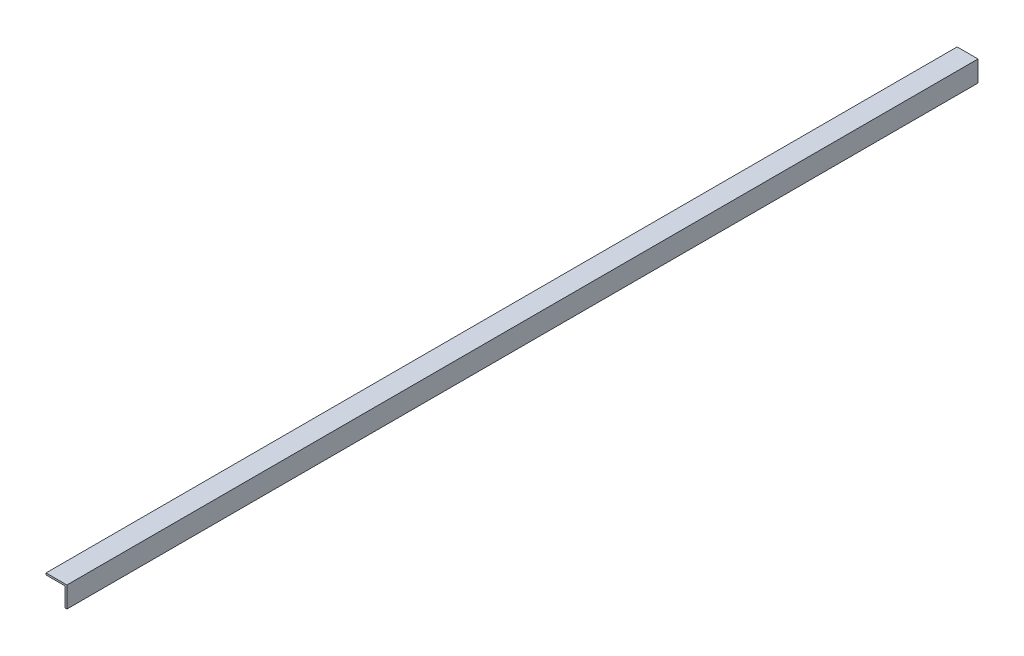
ISO-10303-21;
HEADER;
FILE_DESCRIPTION(('STEP AP214'),'2;1');
FILE_NAME('part.step','',(''),(''),'','','');
FILE_SCHEMA(('AUTOMOTIVE_DESIGN { 1 0 10303 214 1 1 1 1 }'));
ENDSEC;
DATA;
#1=APPLICATION_CONTEXT('core data for automotive mechanical design processes');
#2=APPLICATION_PROTOCOL_DEFINITION('international standard','automotive_design',2000,#1);
#3=PRODUCT_CONTEXT('',#1,'mechanical');
#4=PRODUCT('Part','Part','',(#3));
#5=PRODUCT_RELATED_PRODUCT_CATEGORY('part','',(#4));
#6=PRODUCT_DEFINITION_FORMATION('','',#4);
#7=PRODUCT_DEFINITION_CONTEXT('part definition',#1,'design');
#8=PRODUCT_DEFINITION('design','',#6,#7);
#9=PRODUCT_DEFINITION_SHAPE('','',#8);
#10=(LENGTH_UNIT() NAMED_UNIT(*) SI_UNIT(.MILLI.,.METRE.));
#11=(NAMED_UNIT(*) PLANE_ANGLE_UNIT() SI_UNIT($,.RADIAN.));
#12=(NAMED_UNIT(*) SI_UNIT($,.STERADIAN.) SOLID_ANGLE_UNIT());
#13=UNCERTAINTY_MEASURE_WITH_UNIT(LENGTH_MEASURE(1.E-05),#10,'distance_accuracy_value','');
#14=(GEOMETRIC_REPRESENTATION_CONTEXT(3) GLOBAL_UNCERTAINTY_ASSIGNED_CONTEXT((#13)) GLOBAL_UNIT_ASSIGNED_CONTEXT((#10,
#11,#12)) REPRESENTATION_CONTEXT('',''));
#15=CARTESIAN_POINT('',(0.,0.,0.));
#16=DIRECTION('',(0.,0.,1.));
#17=DIRECTION('',(1.,0.,0.));
#18=AXIS2_PLACEMENT_3D('',#15,#16,#17);
#19=CARTESIAN_POINT('',(0.,-38.1,1662.1125));
#20=DIRECTION('',(-1.,0.,0.));
#21=DIRECTION('',(0.,0.,1.));
#22=AXIS2_PLACEMENT_3D('',#19,#20,#21);
#23=PLANE('',#22);
#24=DIRECTION('',(0.,1.,0.));
#25=VECTOR('',#24,1.);
#26=CARTESIAN_POINT('',(0.,-38.1,0.));
#27=LINE('',#26,#25);
#28=CARTESIAN_POINT('',(0.,-38.1,0.));
#29=VERTEX_POINT('',#28);
#30=CARTESIAN_POINT('',(0.,0.,0.));
#31=VERTEX_POINT('',#30);
#32=EDGE_CURVE('E121',#29,#31,#27,.T.);
#33=ORIENTED_EDGE('',*,*,#32,.T.);
#34=DIRECTION('',(0.,0.,-1.));
#35=VECTOR('',#34,1.);
#36=CARTESIAN_POINT('',(0.,0.,1662.1125));
#37=LINE('',#36,#35);
#38=CARTESIAN_POINT('',(0.,0.,1662.1125));
#39=VERTEX_POINT('',#38);
#40=EDGE_CURVE('E11',#39,#31,#37,.T.);
#41=ORIENTED_EDGE('',*,*,#40,.F.);
#42=DIRECTION('',(0.,1.,0.));
#43=VECTOR('',#42,1.);
#44=CARTESIAN_POINT('',(0.,-38.1,1662.1125));
#45=LINE('',#44,#43);
#46=CARTESIAN_POINT('',(0.,-38.1,1662.1125));
#47=VERTEX_POINT('',#46);
#48=EDGE_CURVE('E131',#47,#39,#45,.T.);
#49=ORIENTED_EDGE('',*,*,#48,.F.);
#50=DIRECTION('',(0.,0.,-1.));
#51=VECTOR('',#50,1.);
#52=CARTESIAN_POINT('',(0.,-38.1,1662.1125));
#53=LINE('',#52,#51);
#54=EDGE_CURVE('E117',#47,#29,#53,.T.);
#55=ORIENTED_EDGE('',*,*,#54,.T.);
#56=EDGE_LOOP('',(#33,#41,#49,#55));
#57=FACE_BOUND('',#56,.T.);
#58=ADVANCED_FACE('F37',(#57),#23,.F.);
#59=CARTESIAN_POINT('',(0.,0.,1662.1125));
#60=DIRECTION('',(0.,-1.,0.));
#61=DIRECTION('',(1.,0.,0.));
#62=AXIS2_PLACEMENT_3D('',#59,#60,#61);
#63=PLANE('',#62);
#64=DIRECTION('',(-1.,0.,0.));
#65=VECTOR('',#64,1.);
#66=CARTESIAN_POINT('',(0.,0.,0.));
#67=LINE('',#66,#65);
#68=CARTESIAN_POINT('',(-38.1,0.,0.));
#69=VERTEX_POINT('',#68);
#70=EDGE_CURVE('E124',#31,#69,#67,.T.);
#71=ORIENTED_EDGE('',*,*,#70,.T.);
#72=DIRECTION('',(0.,0.,-1.));
#73=VECTOR('',#72,1.);
#74=CARTESIAN_POINT('',(-38.1,0.,1662.1125));
#75=LINE('',#74,#73);
#76=CARTESIAN_POINT('',(-38.1,0.,1662.1125));
#77=VERTEX_POINT('',#76);
#78=EDGE_CURVE('E45',#77,#69,#75,.T.);
#79=ORIENTED_EDGE('',*,*,#78,.F.);
#80=DIRECTION('',(-1.,0.,0.));
#81=VECTOR('',#80,1.);
#82=CARTESIAN_POINT('',(0.,0.,1662.1125));
#83=LINE('',#82,#81);
#84=EDGE_CURVE('E90',#39,#77,#83,.T.);
#85=ORIENTED_EDGE('',*,*,#84,.F.);
#86=ORIENTED_EDGE('',*,*,#40,.T.);
#87=EDGE_LOOP('',(#71,#79,#85,#86));
#88=FACE_BOUND('',#87,.T.);
#89=ADVANCED_FACE('F155',(#88),#63,.F.);
#90=CARTESIAN_POINT('',(-38.1,0.,1662.1125));
#91=DIRECTION('',(1.,0.,0.));
#92=DIRECTION('',(0.,0.,-1.));
#93=AXIS2_PLACEMENT_3D('',#90,#91,#92);
#94=PLANE('',#93);
#95=DIRECTION('',(0.,-1.,0.));
#96=VECTOR('',#95,1.);
#97=CARTESIAN_POINT('',(-38.1,0.,0.));
#98=LINE('',#97,#96);
#99=CARTESIAN_POINT('',(-38.1,-3.17500000000001,0.));
#100=VERTEX_POINT('',#99);
#101=EDGE_CURVE('E126',#69,#100,#98,.T.);
#102=ORIENTED_EDGE('',*,*,#101,.T.);
#103=DIRECTION('',(0.,0.,-1.));
#104=VECTOR('',#103,1.);
#105=CARTESIAN_POINT('',(-38.1,-3.17500000000001,1662.1125));
#106=LINE('',#105,#104);
#107=CARTESIAN_POINT('',(-38.1,-3.17500000000001,1662.1125));
#108=VERTEX_POINT('',#107);
#109=EDGE_CURVE('E112',#108,#100,#106,.T.);
#110=ORIENTED_EDGE('',*,*,#109,.F.);
#111=DIRECTION('',(0.,-1.,0.));
#112=VECTOR('',#111,1.);
#113=CARTESIAN_POINT('',(-38.1,0.,1662.1125));
#114=LINE('',#113,#112);
#115=EDGE_CURVE('E103',#77,#108,#114,.T.);
#116=ORIENTED_EDGE('',*,*,#115,.F.);
#117=ORIENTED_EDGE('',*,*,#78,.T.);
#118=EDGE_LOOP('',(#102,#110,#116,#117));
#119=FACE_BOUND('',#118,.T.);
#120=ADVANCED_FACE('F137',(#119),#94,.F.);
#121=CARTESIAN_POINT('',(-38.1,-3.17500000000001,1662.1125));
#122=DIRECTION('',(0.,1.,0.));
#123=DIRECTION('',(0.,0.,1.));
#124=AXIS2_PLACEMENT_3D('',#121,#122,#123);
#125=PLANE('',#124);
#126=DIRECTION('',(1.,0.,0.));
#127=VECTOR('',#126,1.);
#128=CARTESIAN_POINT('',(-38.1,-3.17500000000001,0.));
#129=LINE('',#128,#127);
#130=CARTESIAN_POINT('',(-3.17500000000001,-3.17500000000001,0.));
#131=VERTEX_POINT('',#130);
#132=EDGE_CURVE('E111',#100,#131,#129,.T.);
#133=ORIENTED_EDGE('',*,*,#132,.T.);
#134=DIRECTION('',(0.,0.,-1.));
#135=VECTOR('',#134,1.);
#136=CARTESIAN_POINT('',(-3.17500000000001,-3.17500000000001,1662.1125));
#137=LINE('',#136,#135);
#138=CARTESIAN_POINT('',(-3.17500000000001,-3.17500000000001,1662.1125));
#139=VERTEX_POINT('',#138);
#140=EDGE_CURVE('E108',#139,#131,#137,.T.);
#141=ORIENTED_EDGE('',*,*,#140,.F.);
#142=DIRECTION('',(1.,0.,0.));
#143=VECTOR('',#142,1.);
#144=CARTESIAN_POINT('',(-38.1,-3.17500000000001,1662.1125));
#145=LINE('',#144,#143);
#146=EDGE_CURVE('E97',#108,#139,#145,.T.);
#147=ORIENTED_EDGE('',*,*,#146,.F.);
#148=ORIENTED_EDGE('',*,*,#109,.T.);
#149=EDGE_LOOP('',(#133,#141,#147,#148));
#150=FACE_BOUND('',#149,.T.);
#151=ADVANCED_FACE('F109',(#150),#125,.F.);
#152=CARTESIAN_POINT('',(-3.17500000000001,-3.17500000000001,1662.1125));
#153=DIRECTION('',(1.,0.,0.));
#154=DIRECTION('',(0.,1.,0.));
#155=AXIS2_PLACEMENT_3D('',#152,#153,#154);
#156=PLANE('',#155);
#157=DIRECTION('',(0.,-1.,0.));
#158=VECTOR('',#157,1.);
#159=CARTESIAN_POINT('',(-3.17500000000001,-3.17500000000001,0.));
#160=LINE('',#159,#158);
#161=CARTESIAN_POINT('',(-3.175,-38.1,0.));
#162=VERTEX_POINT('',#161);
#163=EDGE_CURVE('E76',#131,#162,#160,.T.);
#164=ORIENTED_EDGE('',*,*,#163,.T.);
#165=DIRECTION('',(0.,0.,-1.));
#166=VECTOR('',#165,1.);
#167=CARTESIAN_POINT('',(-3.175,-38.1,1662.1125));
#168=LINE('',#167,#166);
#169=CARTESIAN_POINT('',(-3.175,-38.1,1662.1125));
#170=VERTEX_POINT('',#169);
#171=EDGE_CURVE('E113',#170,#162,#168,.T.);
#172=ORIENTED_EDGE('',*,*,#171,.F.);
#173=DIRECTION('',(0.,-1.,0.));
#174=VECTOR('',#173,1.);
#175=CARTESIAN_POINT('',(-3.17500000000001,-3.17500000000001,1662.1125));
#176=LINE('',#175,#174);
#177=EDGE_CURVE('E101',#139,#170,#176,.T.);
#178=ORIENTED_EDGE('',*,*,#177,.F.);
#179=ORIENTED_EDGE('',*,*,#140,.T.);
#180=EDGE_LOOP('',(#164,#172,#178,#179));
#181=FACE_BOUND('',#180,.T.);
#182=ADVANCED_FACE('F115',(#181),#156,.F.);
#183=CARTESIAN_POINT('',(-3.175,-38.1,1662.1125));
#184=DIRECTION('',(0.,1.,0.));
#185=DIRECTION('',(0.,0.,1.));
#186=AXIS2_PLACEMENT_3D('',#183,#184,#185);
#187=PLANE('',#186);
#188=DIRECTION('',(1.,0.,0.));
#189=VECTOR('',#188,1.);
#190=CARTESIAN_POINT('',(-3.175,-38.1,0.));
#191=LINE('',#190,#189);
#192=EDGE_CURVE('E82',#162,#29,#191,.T.);
#193=ORIENTED_EDGE('',*,*,#192,.T.);
#194=ORIENTED_EDGE('',*,*,#54,.F.);
#195=DIRECTION('',(1.,0.,0.));
#196=VECTOR('',#195,1.);
#197=CARTESIAN_POINT('',(-3.175,-38.1,1662.1125));
#198=LINE('',#197,#196);
#199=EDGE_CURVE('E53',#170,#47,#198,.T.);
#200=ORIENTED_EDGE('',*,*,#199,.F.);
#201=ORIENTED_EDGE('',*,*,#171,.T.);
#202=EDGE_LOOP('',(#193,#194,#200,#201));
#203=FACE_BOUND('',#202,.T.);
#204=ADVANCED_FACE('F144',(#203),#187,.F.);
#205=CARTESIAN_POINT('',(0.,0.,1662.1125));
#206=DIRECTION('',(0.,0.,1.));
#207=DIRECTION('',(1.,0.,0.));
#208=AXIS2_PLACEMENT_3D('',#205,#206,#207);
#209=PLANE('',#208);
#210=ORIENTED_EDGE('',*,*,#48,.T.);
#211=ORIENTED_EDGE('',*,*,#84,.T.);
#212=ORIENTED_EDGE('',*,*,#115,.T.);
#213=ORIENTED_EDGE('',*,*,#146,.T.);
#214=ORIENTED_EDGE('',*,*,#177,.T.);
#215=ORIENTED_EDGE('',*,*,#199,.T.);
#216=EDGE_LOOP('',(#210,#211,#212,#213,#214,#215));
#217=FACE_BOUND('',#216,.T.);
#218=ADVANCED_FACE('F99',(#217),#209,.T.);
#219=CARTESIAN_POINT('',(0.,0.,0.));
#220=DIRECTION('',(0.,0.,1.));
#221=DIRECTION('',(1.,0.,0.));
#222=AXIS2_PLACEMENT_3D('',#219,#220,#221);
#223=PLANE('',#222);
#224=ORIENTED_EDGE('',*,*,#32,.F.);
#225=ORIENTED_EDGE('',*,*,#192,.F.);
#226=ORIENTED_EDGE('',*,*,#163,.F.);
#227=ORIENTED_EDGE('',*,*,#132,.F.);
#228=ORIENTED_EDGE('',*,*,#101,.F.);
#229=ORIENTED_EDGE('',*,*,#70,.F.);
#230=EDGE_LOOP('',(#224,#225,#226,#227,#228,#229));
#231=FACE_BOUND('',#230,.T.);
#232=ADVANCED_FACE('F140',(#231),#223,.F.);
#233=CLOSED_SHELL('',(#58,#89,#120,#151,#182,#204,#218,#232));
#234=MANIFOLD_SOLID_BREP('B2',#233);
#235=ADVANCED_BREP_SHAPE_REPRESENTATION('',(#18,#234),#14);
#236=SHAPE_DEFINITION_REPRESENTATION(#9,#235);
ENDSEC;
END-ISO-10303-21;
